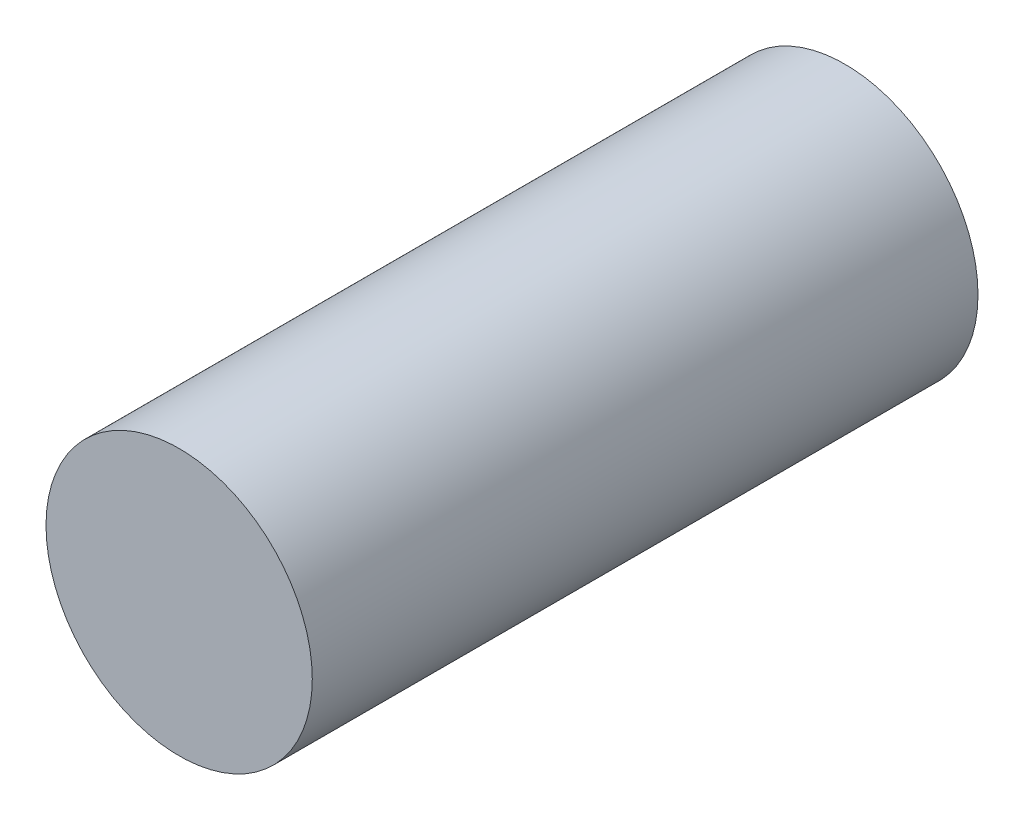
ISO-10303-21;
HEADER;
FILE_DESCRIPTION(('STEP AP214'),'2;1');
FILE_NAME('part.step','',(''),(''),'','','');
FILE_SCHEMA(('AUTOMOTIVE_DESIGN { 1 0 10303 214 1 1 1 1 }'));
ENDSEC;
DATA;
#1=APPLICATION_CONTEXT('core data for automotive mechanical design processes');
#2=APPLICATION_PROTOCOL_DEFINITION('international standard','automotive_design',2000,#1);
#3=PRODUCT_CONTEXT('',#1,'mechanical');
#4=PRODUCT('Part','Part','',(#3));
#5=PRODUCT_RELATED_PRODUCT_CATEGORY('part','',(#4));
#6=PRODUCT_DEFINITION_FORMATION('','',#4);
#7=PRODUCT_DEFINITION_CONTEXT('part definition',#1,'design');
#8=PRODUCT_DEFINITION('design','',#6,#7);
#9=PRODUCT_DEFINITION_SHAPE('','',#8);
#10=(LENGTH_UNIT() NAMED_UNIT(*) SI_UNIT(.MILLI.,.METRE.));
#11=(NAMED_UNIT(*) PLANE_ANGLE_UNIT() SI_UNIT($,.RADIAN.));
#12=(NAMED_UNIT(*) SI_UNIT($,.STERADIAN.) SOLID_ANGLE_UNIT());
#13=UNCERTAINTY_MEASURE_WITH_UNIT(LENGTH_MEASURE(1.E-05),#10,'distance_accuracy_value','');
#14=(GEOMETRIC_REPRESENTATION_CONTEXT(3) GLOBAL_UNCERTAINTY_ASSIGNED_CONTEXT((#13)) GLOBAL_UNIT_ASSIGNED_CONTEXT((#10,
#11,#12)) REPRESENTATION_CONTEXT('',''));
#15=CARTESIAN_POINT('',(0.,0.,0.));
#16=DIRECTION('',(0.,0.,1.));
#17=DIRECTION('',(1.,0.,0.));
#18=AXIS2_PLACEMENT_3D('',#15,#16,#17);
#19=CARTESIAN_POINT('',(0.,0.,10.));
#20=DIRECTION('',(0.,0.,-1.));
#21=DIRECTION('',(-1.,0.,0.));
#22=AXIS2_PLACEMENT_3D('',#19,#20,#21);
#23=CYLINDRICAL_SURFACE('',#22,2.);
#24=CARTESIAN_POINT('',(0.,0.,10.));
#25=DIRECTION('',(0.,0.,1.));
#26=DIRECTION('',(1.,0.,0.));
#27=AXIS2_PLACEMENT_3D('',#24,#25,#26);
#28=CIRCLE('',#27,2.);
#29=CARTESIAN_POINT('',(2.,0.,10.));
#30=VERTEX_POINT('',#29);
#31=EDGE_CURVE('E10',#30,#30,#28,.T.);
#32=ORIENTED_EDGE('',*,*,#31,.F.);
#33=EDGE_LOOP('',(#32));
#34=FACE_BOUND('',#33,.T.);
#35=CARTESIAN_POINT('',(0.,0.,0.));
#36=DIRECTION('',(0.,0.,1.));
#37=DIRECTION('',(1.,0.,0.));
#38=AXIS2_PLACEMENT_3D('',#35,#36,#37);
#39=CIRCLE('',#38,2.);
#40=CARTESIAN_POINT('',(2.,0.,0.));
#41=VERTEX_POINT('',#40);
#42=EDGE_CURVE('E40',#41,#41,#39,.T.);
#43=ORIENTED_EDGE('',*,*,#42,.T.);
#44=EDGE_LOOP('',(#43));
#45=FACE_BOUND('',#44,.T.);
#46=ADVANCED_FACE('F37',(#34,#45),#23,.T.);
#47=CARTESIAN_POINT('',(0.,0.,10.));
#48=DIRECTION('',(0.,0.,1.));
#49=DIRECTION('',(1.,0.,0.));
#50=AXIS2_PLACEMENT_3D('',#47,#48,#49);
#51=PLANE('',#50);
#52=ORIENTED_EDGE('',*,*,#31,.T.);
#53=EDGE_LOOP('',(#52));
#54=FACE_BOUND('',#53,.T.);
#55=ADVANCED_FACE('F54',(#54),#51,.T.);
#56=CARTESIAN_POINT('',(0.,0.,0.));
#57=DIRECTION('',(0.,0.,1.));
#58=DIRECTION('',(1.,0.,0.));
#59=AXIS2_PLACEMENT_3D('',#56,#57,#58);
#60=PLANE('',#59);
#61=ORIENTED_EDGE('',*,*,#42,.F.);
#62=EDGE_LOOP('',(#61));
#63=FACE_BOUND('',#62,.T.);
#64=ADVANCED_FACE('F52',(#63),#60,.F.);
#65=CLOSED_SHELL('',(#46,#55,#64));
#66=MANIFOLD_SOLID_BREP('B2',#65);
#67=ADVANCED_BREP_SHAPE_REPRESENTATION('',(#18,#66),#14);
#68=SHAPE_DEFINITION_REPRESENTATION(#9,#67);
ENDSEC;
END-ISO-10303-21;
